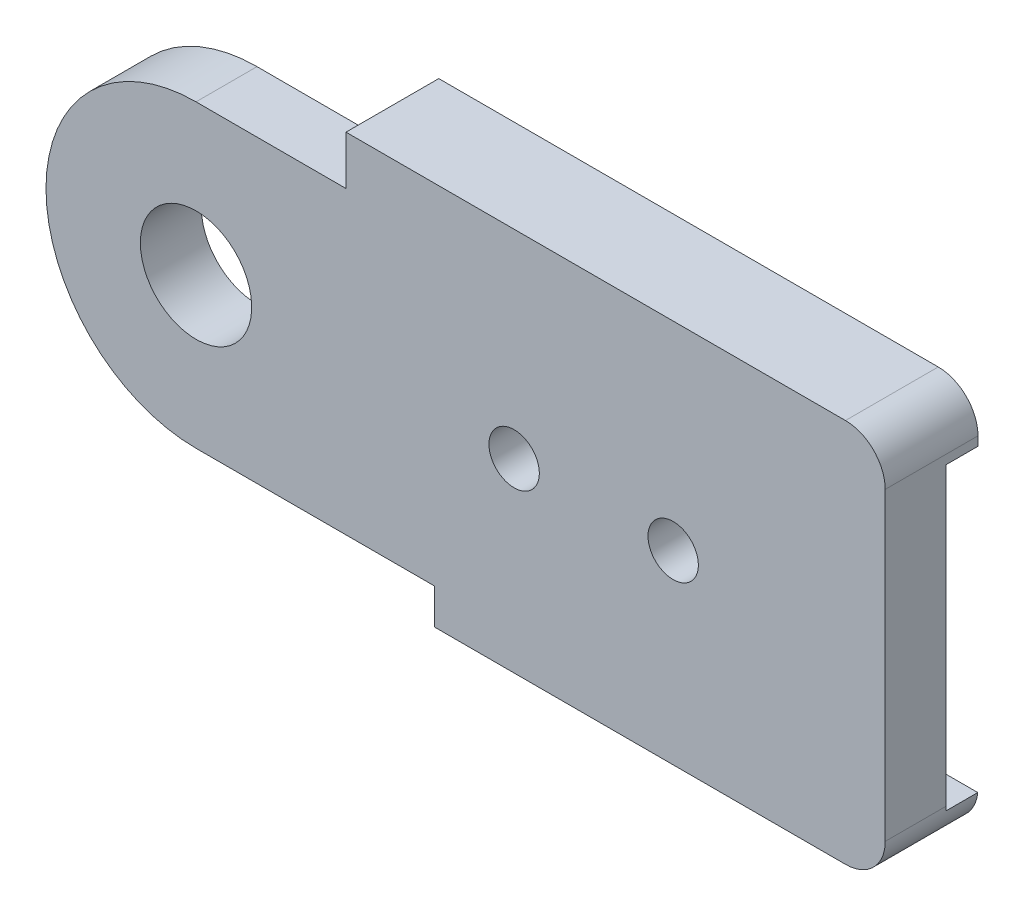
ISO-10303-21;
HEADER;
FILE_DESCRIPTION(('STEP AP214'),'2;1');
FILE_NAME('part.step','',(''),(''),'','','');
FILE_SCHEMA(('AUTOMOTIVE_DESIGN { 1 0 10303 214 1 1 1 1 }'));
ENDSEC;
DATA;
#1=APPLICATION_CONTEXT('core data for automotive mechanical design processes');
#2=APPLICATION_PROTOCOL_DEFINITION('international standard','automotive_design',2000,#1);
#3=PRODUCT_CONTEXT('',#1,'mechanical');
#4=PRODUCT('Part','Part','',(#3));
#5=PRODUCT_RELATED_PRODUCT_CATEGORY('part','',(#4));
#6=PRODUCT_DEFINITION_FORMATION('','',#4);
#7=PRODUCT_DEFINITION_CONTEXT('part definition',#1,'design');
#8=PRODUCT_DEFINITION('design','',#6,#7);
#9=PRODUCT_DEFINITION_SHAPE('','',#8);
#10=(LENGTH_UNIT() NAMED_UNIT(*) SI_UNIT(.MILLI.,.METRE.));
#11=(NAMED_UNIT(*) PLANE_ANGLE_UNIT() SI_UNIT($,.RADIAN.));
#12=(NAMED_UNIT(*) SI_UNIT($,.STERADIAN.) SOLID_ANGLE_UNIT());
#13=UNCERTAINTY_MEASURE_WITH_UNIT(LENGTH_MEASURE(1.E-05),#10,'distance_accuracy_value','');
#14=(GEOMETRIC_REPRESENTATION_CONTEXT(3) GLOBAL_UNCERTAINTY_ASSIGNED_CONTEXT((#13)) GLOBAL_UNIT_ASSIGNED_CONTEXT((#10,
#11,#12)) REPRESENTATION_CONTEXT('',''));
#15=CARTESIAN_POINT('',(0.,0.,0.));
#16=DIRECTION('',(0.,0.,1.));
#17=DIRECTION('',(1.,0.,0.));
#18=AXIS2_PLACEMENT_3D('',#15,#16,#17);
#19=CARTESIAN_POINT('',(12.,0.,-6.));
#20=DIRECTION('',(0.,0.,1.));
#21=DIRECTION('',(1.,0.,0.));
#22=AXIS2_PLACEMENT_3D('',#19,#20,#21);
#23=CYLINDRICAL_SURFACE('',#22,2.5);
#24=CARTESIAN_POINT('',(12.,0.,-6.));
#25=DIRECTION('',(0.,0.,-1.));
#26=DIRECTION('',(-1.,0.,0.));
#27=AXIS2_PLACEMENT_3D('',#24,#25,#26);
#28=CIRCLE('',#27,2.5);
#29=CARTESIAN_POINT('',(9.50000000000001,0.,-6.));
#30=VERTEX_POINT('',#29);
#31=EDGE_CURVE('E223',#30,#30,#28,.T.);
#32=ORIENTED_EDGE('',*,*,#31,.F.);
#33=EDGE_LOOP('',(#32));
#34=FACE_BOUND('',#33,.T.);
#35=CARTESIAN_POINT('',(12.,0.,-4.8));
#36=DIRECTION('',(0.,0.,-1.));
#37=DIRECTION('',(-1.,0.,0.));
#38=AXIS2_PLACEMENT_3D('',#35,#36,#37);
#39=CIRCLE('',#38,2.5);
#40=CARTESIAN_POINT('',(9.50000000000001,0.,-4.8));
#41=VERTEX_POINT('',#40);
#42=EDGE_CURVE('E219',#41,#41,#39,.T.);
#43=ORIENTED_EDGE('',*,*,#42,.T.);
#44=EDGE_LOOP('',(#43));
#45=FACE_BOUND('',#44,.T.);
#46=ADVANCED_FACE('F40',(#34,#45),#23,.T.);
#47=CARTESIAN_POINT('',(18.,0.,-6.));
#48=DIRECTION('',(0.,0.,1.));
#49=DIRECTION('',(1.,0.,0.));
#50=AXIS2_PLACEMENT_3D('',#47,#48,#49);
#51=CYLINDRICAL_SURFACE('',#50,2.5);
#52=CARTESIAN_POINT('',(18.,0.,-6.));
#53=DIRECTION('',(0.,0.,-1.));
#54=DIRECTION('',(-1.,0.,0.));
#55=AXIS2_PLACEMENT_3D('',#52,#53,#54);
#56=CIRCLE('',#55,2.5);
#57=CARTESIAN_POINT('',(15.5,0.,-6.));
#58=VERTEX_POINT('',#57);
#59=EDGE_CURVE('E215',#58,#58,#56,.T.);
#60=ORIENTED_EDGE('',*,*,#59,.F.);
#61=EDGE_LOOP('',(#60));
#62=FACE_BOUND('',#61,.T.);
#63=CARTESIAN_POINT('',(18.,0.,-4.8));
#64=DIRECTION('',(0.,0.,-1.));
#65=DIRECTION('',(-1.,0.,0.));
#66=AXIS2_PLACEMENT_3D('',#63,#64,#65);
#67=CIRCLE('',#66,2.5);
#68=CARTESIAN_POINT('',(15.5,0.,-4.8));
#69=VERTEX_POINT('',#68);
#70=EDGE_CURVE('E211',#69,#69,#67,.T.);
#71=ORIENTED_EDGE('',*,*,#70,.T.);
#72=EDGE_LOOP('',(#71));
#73=FACE_BOUND('',#72,.T.);
#74=ADVANCED_FACE('F405',(#62,#73),#51,.T.);
#75=CARTESIAN_POINT('',(26.,5.65685424949239,-6.));
#76=DIRECTION('',(0.,1.,0.));
#77=DIRECTION('',(-1.,0.,0.));
#78=AXIS2_PLACEMENT_3D('',#75,#76,#77);
#79=PLANE('',#78);
#80=DIRECTION('',(-1.,0.,0.));
#81=VECTOR('',#80,1.);
#82=CARTESIAN_POINT('',(26.,5.65685424949239,-4.8));
#83=LINE('',#82,#81);
#84=CARTESIAN_POINT('',(26.,5.65685424949239,-4.8));
#85=VERTEX_POINT('',#84);
#86=CARTESIAN_POINT('',(5.65685424949238,5.65685424949239,-4.8));
#87=VERTEX_POINT('',#86);
#88=EDGE_CURVE('E179',#85,#87,#83,.T.);
#89=ORIENTED_EDGE('',*,*,#88,.T.);
#90=DIRECTION('',(0.,0.,1.));
#91=VECTOR('',#90,1.);
#92=CARTESIAN_POINT('',(5.65685424949238,5.65685424949239,-6.));
#93=LINE('',#92,#91);
#94=CARTESIAN_POINT('',(5.65685424949238,5.65685424949239,-6.));
#95=VERTEX_POINT('',#94);
#96=EDGE_CURVE('E202',#95,#87,#93,.T.);
#97=ORIENTED_EDGE('',*,*,#96,.F.);
#98=DIRECTION('',(-1.,0.,0.));
#99=VECTOR('',#98,1.);
#100=CARTESIAN_POINT('',(26.,5.65685424949239,-6.));
#101=LINE('',#100,#99);
#102=CARTESIAN_POINT('',(26.,5.65685424949239,-6.));
#103=VERTEX_POINT('',#102);
#104=EDGE_CURVE('E180',#103,#95,#101,.T.);
#105=ORIENTED_EDGE('',*,*,#104,.F.);
#106=DIRECTION('',(0.,0.,1.));
#107=VECTOR('',#106,1.);
#108=CARTESIAN_POINT('',(26.,5.65685424949239,-6.));
#109=LINE('',#108,#107);
#110=EDGE_CURVE('E195',#103,#85,#109,.T.);
#111=ORIENTED_EDGE('',*,*,#110,.T.);
#112=EDGE_LOOP('',(#89,#97,#105,#111));
#113=FACE_BOUND('',#112,.T.);
#114=ADVANCED_FACE('F372',(#113),#79,.F.);
#115=CARTESIAN_POINT('',(9.00000000000001,-7.00163526528755,2.));
#116=DIRECTION('',(1.,0.,0.));
#117=DIRECTION('',(0.,0.,-1.));
#118=AXIS2_PLACEMENT_3D('',#115,#116,#117);
#119=PLANE('',#118);
#120=DIRECTION('',(0.,0.,-1.));
#121=VECTOR('',#120,1.);
#122=CARTESIAN_POINT('',(9.00000000000001,-7.00163526528755,2.));
#123=LINE('',#122,#121);
#124=CARTESIAN_POINT('',(9.00000000000001,-7.00163526528755,-2.5));
#125=VERTEX_POINT('',#124);
#126=CARTESIAN_POINT('',(9.00000000000001,-7.00163526528755,-6.));
#127=VERTEX_POINT('',#126);
#128=EDGE_CURVE('E139',#125,#127,#123,.T.);
#129=ORIENTED_EDGE('',*,*,#128,.F.);
#130=DIRECTION('',(0.,1.,0.));
#131=VECTOR('',#130,1.);
#132=CARTESIAN_POINT('',(9.00000000000001,-7.00163526528755,-2.5));
#133=LINE('',#132,#131);
#134=CARTESIAN_POINT('',(9.00000000000001,-5.6599991249669,-2.5));
#135=VERTEX_POINT('',#134);
#136=EDGE_CURVE('E315',#125,#135,#133,.T.);
#137=ORIENTED_EDGE('',*,*,#136,.T.);
#138=DIRECTION('',(0.,0.,1.));
#139=VECTOR('',#138,1.);
#140=CARTESIAN_POINT('',(9.00000000000001,-5.6599991249669,-4.8));
#141=LINE('',#140,#139);
#142=CARTESIAN_POINT('',(9.00000000000001,-5.6599991249669,-4.8));
#143=VERTEX_POINT('',#142);
#144=EDGE_CURVE('E253',#143,#135,#141,.T.);
#145=ORIENTED_EDGE('',*,*,#144,.F.);
#146=DIRECTION('',(0.,0.,1.));
#147=VECTOR('',#146,1.);
#148=CARTESIAN_POINT('',(9.00000000000001,-5.6599991249669,-6.));
#149=LINE('',#148,#147);
#150=CARTESIAN_POINT('',(9.00000000000001,-5.6599991249669,-6.));
#151=VERTEX_POINT('',#150);
#152=EDGE_CURVE('E166',#151,#143,#149,.T.);
#153=ORIENTED_EDGE('',*,*,#152,.F.);
#154=DIRECTION('',(0.,1.,0.));
#155=VECTOR('',#154,1.);
#156=CARTESIAN_POINT('',(9.00000000000001,-7.00163526528755,-6.));
#157=LINE('',#156,#155);
#158=EDGE_CURVE('E156',#127,#151,#157,.T.);
#159=ORIENTED_EDGE('',*,*,#158,.F.);
#160=EDGE_LOOP('',(#129,#137,#145,#153,#159));
#161=FACE_BOUND('',#160,.T.);
#162=ADVANCED_FACE('F163',(#161),#119,.F.);
#163=CARTESIAN_POINT('',(0.,-5.6599991249669,-4.8));
#164=DIRECTION('',(0.,1.,0.));
#165=DIRECTION('',(0.,0.,1.));
#166=AXIS2_PLACEMENT_3D('',#163,#164,#165);
#167=PLANE('',#166);
#168=DIRECTION('',(-1.,0.,0.));
#169=VECTOR('',#168,1.);
#170=CARTESIAN_POINT('',(0.,-5.6599991249669,-2.5));
#171=LINE('',#170,#169);
#172=CARTESIAN_POINT('',(0.,-5.6599991249669,-2.5));
#173=VERTEX_POINT('',#172);
#174=EDGE_CURVE('E238',#135,#173,#171,.T.);
#175=ORIENTED_EDGE('',*,*,#174,.T.);
#176=DIRECTION('',(0.,0.,1.));
#177=VECTOR('',#176,1.);
#178=CARTESIAN_POINT('',(0.,-5.6599991249669,-4.8));
#179=LINE('',#178,#177);
#180=CARTESIAN_POINT('',(0.,-5.6599991249669,-4.8));
#181=VERTEX_POINT('',#180);
#182=EDGE_CURVE('E277',#181,#173,#179,.T.);
#183=ORIENTED_EDGE('',*,*,#182,.F.);
#184=DIRECTION('',(-1.,0.,0.));
#185=VECTOR('',#184,1.);
#186=CARTESIAN_POINT('',(0.,-5.6599991249669,-4.8));
#187=LINE('',#186,#185);
#188=EDGE_CURVE('E239',#143,#181,#187,.T.);
#189=ORIENTED_EDGE('',*,*,#188,.F.);
#190=ORIENTED_EDGE('',*,*,#144,.T.);
#191=EDGE_LOOP('',(#175,#183,#189,#190));
#192=FACE_BOUND('',#191,.T.);
#193=ADVANCED_FACE('F352',(#192),#167,.F.);
#194=CARTESIAN_POINT('',(0.,0.,-4.8));
#195=DIRECTION('',(0.,0.,1.));
#196=DIRECTION('',(1.,0.,0.));
#197=AXIS2_PLACEMENT_3D('',#194,#195,#196);
#198=CYLINDRICAL_SURFACE('',#197,5.65999868763295);
#199=CARTESIAN_POINT('',(0.,0.,-2.5));
#200=DIRECTION('',(0.,0.,-1.));
#201=DIRECTION('',(-1.,0.,0.));
#202=AXIS2_PLACEMENT_3D('',#199,#200,#201);
#203=CIRCLE('',#202,5.65999868763295);
#204=CARTESIAN_POINT('',(0.,5.65999912496691,-2.5));
#205=VERTEX_POINT('',#204);
#206=EDGE_CURVE('E257',#173,#205,#203,.T.);
#207=ORIENTED_EDGE('',*,*,#206,.T.);
#208=DIRECTION('',(0.,0.,1.));
#209=VECTOR('',#208,1.);
#210=CARTESIAN_POINT('',(0.,5.65999912496691,-4.8));
#211=LINE('',#210,#209);
#212=CARTESIAN_POINT('',(0.,5.65999912496691,-4.8));
#213=VERTEX_POINT('',#212);
#214=EDGE_CURVE('E273',#213,#205,#211,.T.);
#215=ORIENTED_EDGE('',*,*,#214,.F.);
#216=CARTESIAN_POINT('',(0.,0.,-4.8));
#217=DIRECTION('',(0.,0.,-1.));
#218=DIRECTION('',(-1.,0.,0.));
#219=AXIS2_PLACEMENT_3D('',#216,#217,#218);
#220=CIRCLE('',#219,5.65999868763295);
#221=EDGE_CURVE('E243',#181,#213,#220,.T.);
#222=ORIENTED_EDGE('',*,*,#221,.F.);
#223=ORIENTED_EDGE('',*,*,#182,.T.);
#224=EDGE_LOOP('',(#207,#215,#222,#223));
#225=FACE_BOUND('',#224,.T.);
#226=ADVANCED_FACE('F348',(#225),#198,.T.);
#227=CARTESIAN_POINT('',(5.65685424949238,7.49836473471238,2.));
#228=DIRECTION('',(0.,-1.,0.));
#229=DIRECTION('',(1.,0.,0.));
#230=AXIS2_PLACEMENT_3D('',#227,#228,#229);
#231=PLANE('',#230);
#232=DIRECTION('',(0.,0.,-1.));
#233=VECTOR('',#232,1.);
#234=CARTESIAN_POINT('',(5.65685424949238,7.49836473471238,2.));
#235=LINE('',#234,#233);
#236=CARTESIAN_POINT('',(5.65685424949238,7.49836473471238,-2.5));
#237=VERTEX_POINT('',#236);
#238=CARTESIAN_POINT('',(5.65685424949238,7.49836473471238,-6.));
#239=VERTEX_POINT('',#238);
#240=EDGE_CURVE('E151',#237,#239,#235,.T.);
#241=ORIENTED_EDGE('',*,*,#240,.F.);
#242=DIRECTION('',(1.,0.,0.));
#243=VECTOR('',#242,1.);
#244=CARTESIAN_POINT('',(5.65685424949238,7.49836473471238,-2.5));
#245=LINE('',#244,#243);
#246=CARTESIAN_POINT('',(24.5,7.49836473471239,-2.5));
#247=VERTEX_POINT('',#246);
#248=EDGE_CURVE('E58',#237,#247,#245,.T.);
#249=ORIENTED_EDGE('',*,*,#248,.T.);
#250=DIRECTION('',(0.,0.,-1.));
#251=VECTOR('',#250,1.);
#252=CARTESIAN_POINT('',(24.5,7.49836473471239,2.));
#253=LINE('',#252,#251);
#254=CARTESIAN_POINT('',(24.5,7.49836473471239,-6.));
#255=VERTEX_POINT('',#254);
#256=EDGE_CURVE('E300',#247,#255,#253,.T.);
#257=ORIENTED_EDGE('',*,*,#256,.T.);
#258=DIRECTION('',(1.,0.,0.));
#259=VECTOR('',#258,1.);
#260=CARTESIAN_POINT('',(5.65685424949238,7.49836473471238,-6.));
#261=LINE('',#260,#259);
#262=EDGE_CURVE('E188',#239,#255,#261,.T.);
#263=ORIENTED_EDGE('',*,*,#262,.F.);
#264=EDGE_LOOP('',(#241,#249,#257,#263));
#265=FACE_BOUND('',#264,.T.);
#266=ADVANCED_FACE('F351',(#265),#231,.F.);
#267=CARTESIAN_POINT('',(0.,0.,-6.));
#268=DIRECTION('',(0.,0.,-1.));
#269=DIRECTION('',(-1.,0.,0.));
#270=AXIS2_PLACEMENT_3D('',#267,#268,#269);
#271=PLANE('',#270);
#272=ORIENTED_EDGE('',*,*,#262,.T.);
#273=CARTESIAN_POINT('',(24.5,5.99836473471239,-6.));
#274=DIRECTION('',(0.,0.,-1.));
#275=DIRECTION('',(-1.,0.,0.));
#276=AXIS2_PLACEMENT_3D('',#273,#274,#275);
#277=CIRCLE('',#276,1.5);
#278=CARTESIAN_POINT('',(26.,5.99836473471239,-6.));
#279=VERTEX_POINT('',#278);
#280=EDGE_CURVE('E303',#255,#279,#277,.T.);
#281=ORIENTED_EDGE('',*,*,#280,.T.);
#282=DIRECTION('',(0.,-1.,0.));
#283=VECTOR('',#282,1.);
#284=CARTESIAN_POINT('',(26.,7.49836473471239,-6.));
#285=LINE('',#284,#283);
#286=EDGE_CURVE('E192',#279,#103,#285,.T.);
#287=ORIENTED_EDGE('',*,*,#286,.T.);
#288=ORIENTED_EDGE('',*,*,#104,.T.);
#289=DIRECTION('',(0.,1.,0.));
#290=VECTOR('',#289,1.);
#291=CARTESIAN_POINT('',(5.65685424949238,5.65685424949239,-6.));
#292=LINE('',#291,#290);
#293=EDGE_CURVE('E184',#95,#239,#292,.T.);
#294=ORIENTED_EDGE('',*,*,#293,.T.);
#295=EDGE_LOOP('',(#272,#281,#287,#288,#294));
#296=FACE_BOUND('',#295,.T.);
#297=ADVANCED_FACE('F363',(#296),#271,.T.);
#298=CARTESIAN_POINT('',(26.,-7.00163526528755,2.));
#299=DIRECTION('',(-1.,0.,0.));
#300=DIRECTION('',(0.,0.,1.));
#301=AXIS2_PLACEMENT_3D('',#298,#299,#300);
#302=PLANE('',#301);
#303=DIRECTION('',(0.,0.,-1.));
#304=VECTOR('',#303,1.);
#305=CARTESIAN_POINT('',(26.,5.99836473471239,2.));
#306=LINE('',#305,#304);
#307=CARTESIAN_POINT('',(26.,5.99836473471239,-2.5));
#308=VERTEX_POINT('',#307);
#309=EDGE_CURVE('E150',#279,#308,#306,.F.);
#310=ORIENTED_EDGE('',*,*,#309,.T.);
#311=DIRECTION('',(0.,-1.,0.));
#312=VECTOR('',#311,1.);
#313=CARTESIAN_POINT('',(26.,0.,-2.5));
#314=LINE('',#313,#312);
#315=CARTESIAN_POINT('',(26.,-5.50163526528755,-2.5));
#316=VERTEX_POINT('',#315);
#317=EDGE_CURVE('E64',#308,#316,#314,.T.);
#318=ORIENTED_EDGE('',*,*,#317,.T.);
#319=DIRECTION('',(0.,0.,-1.));
#320=VECTOR('',#319,1.);
#321=CARTESIAN_POINT('',(26.,-5.50163526528755,2.));
#322=LINE('',#321,#320);
#323=CARTESIAN_POINT('',(26.,-5.50163526528755,-4.8));
#324=VERTEX_POINT('',#323);
#325=EDGE_CURVE('E286',#316,#324,#322,.T.);
#326=ORIENTED_EDGE('',*,*,#325,.T.);
#327=DIRECTION('',(0.,-1.,0.));
#328=VECTOR('',#327,1.);
#329=CARTESIAN_POINT('',(26.,0.,-4.8));
#330=LINE('',#329,#328);
#331=EDGE_CURVE('E249',#85,#324,#330,.T.);
#332=ORIENTED_EDGE('',*,*,#331,.F.);
#333=ORIENTED_EDGE('',*,*,#110,.F.);
#334=ORIENTED_EDGE('',*,*,#286,.F.);
#335=EDGE_LOOP('',(#310,#318,#326,#332,#333,#334));
#336=FACE_BOUND('',#335,.T.);
#337=ADVANCED_FACE('F364',(#336),#302,.F.);
#338=CARTESIAN_POINT('',(24.5,5.99836473471239,2.));
#339=DIRECTION('',(0.,0.,-1.));
#340=DIRECTION('',(-1.,0.,0.));
#341=AXIS2_PLACEMENT_3D('',#338,#339,#340);
#342=CYLINDRICAL_SURFACE('',#341,1.5);
#343=CARTESIAN_POINT('',(24.5,5.99836473471239,-2.5));
#344=DIRECTION('',(0.,0.,-1.));
#345=DIRECTION('',(-1.,0.,0.));
#346=AXIS2_PLACEMENT_3D('',#343,#344,#345);
#347=CIRCLE('',#346,1.5);
#348=EDGE_CURVE('E11',#308,#247,#347,.F.);
#349=ORIENTED_EDGE('',*,*,#348,.F.);
#350=ORIENTED_EDGE('',*,*,#309,.F.);
#351=ORIENTED_EDGE('',*,*,#280,.F.);
#352=ORIENTED_EDGE('',*,*,#256,.F.);
#353=EDGE_LOOP('',(#349,#350,#351,#352));
#354=FACE_BOUND('',#353,.T.);
#355=ADVANCED_FACE('F367',(#354),#342,.T.);
#356=CARTESIAN_POINT('',(0.,0.,-4.8));
#357=DIRECTION('',(0.,0.,-1.));
#358=DIRECTION('',(-1.,0.,0.));
#359=AXIS2_PLACEMENT_3D('',#356,#357,#358);
#360=PLANE('',#359);
#361=ORIENTED_EDGE('',*,*,#70,.F.);
#362=EDGE_LOOP('',(#361));
#363=FACE_BOUND('',#362,.T.);
#364=ORIENTED_EDGE('',*,*,#42,.F.);
#365=EDGE_LOOP('',(#364));
#366=FACE_BOUND('',#365,.T.);
#367=CARTESIAN_POINT('',(0.,0.,-4.8));
#368=DIRECTION('',(0.,0.,-1.));
#369=DIRECTION('',(-1.,0.,0.));
#370=AXIS2_PLACEMENT_3D('',#367,#368,#369);
#371=CIRCLE('',#370,2.1);
#372=CARTESIAN_POINT('',(-2.1,0.,-4.8));
#373=VERTEX_POINT('',#372);
#374=EDGE_CURVE('E227',#373,#373,#371,.T.);
#375=ORIENTED_EDGE('',*,*,#374,.F.);
#376=EDGE_LOOP('',(#375));
#377=FACE_BOUND('',#376,.T.);
#378=ORIENTED_EDGE('',*,*,#331,.T.);
#379=CARTESIAN_POINT('',(24.5,-5.50163526528755,-4.8));
#380=DIRECTION('',(0.,0.,-1.));
#381=DIRECTION('',(-1.,0.,0.));
#382=AXIS2_PLACEMENT_3D('',#379,#380,#381);
#383=CIRCLE('',#382,1.5);
#384=CARTESIAN_POINT('',(25.9916168703616,-5.6599991249669,-4.8));
#385=VERTEX_POINT('',#384);
#386=EDGE_CURVE('E289',#324,#385,#383,.T.);
#387=ORIENTED_EDGE('',*,*,#386,.T.);
#388=DIRECTION('',(1.,0.,0.));
#389=VECTOR('',#388,1.);
#390=CARTESIAN_POINT('',(9.00000000000001,-5.6599991249669,-4.8));
#391=LINE('',#390,#389);
#392=EDGE_CURVE('E161',#143,#385,#391,.T.);
#393=ORIENTED_EDGE('',*,*,#392,.F.);
#394=ORIENTED_EDGE('',*,*,#188,.T.);
#395=ORIENTED_EDGE('',*,*,#221,.T.);
#396=DIRECTION('',(0.999999845465009,-0.000555940607591913,0.));
#397=VECTOR('',#396,1.);
#398=CARTESIAN_POINT('',(0.00314662286624039,5.65999737563121,-4.8));
#399=LINE('',#398,#397);
#400=EDGE_CURVE('E246',#213,#87,#399,.T.);
#401=ORIENTED_EDGE('',*,*,#400,.T.);
#402=ORIENTED_EDGE('',*,*,#88,.F.);
#403=EDGE_LOOP('',(#378,#387,#393,#394,#395,#401,#402));
#404=FACE_BOUND('',#403,.T.);
#405=ADVANCED_FACE('F340',(#363,#366,#377,#404),#360,.T.);
#406=CARTESIAN_POINT('',(9.00000000000001,-5.6599991249669,-6.));
#407=DIRECTION('',(0.,-1.,0.));
#408=DIRECTION('',(1.,0.,0.));
#409=AXIS2_PLACEMENT_3D('',#406,#407,#408);
#410=PLANE('',#409);
#411=ORIENTED_EDGE('',*,*,#392,.T.);
#412=DIRECTION('',(0.,0.,-1.));
#413=VECTOR('',#412,1.);
#414=CARTESIAN_POINT('',(25.9916168703616,-5.6599991249669,-4.8));
#415=LINE('',#414,#413);
#416=CARTESIAN_POINT('',(25.9916168703616,-5.6599991249669,-6.));
#417=VERTEX_POINT('',#416);
#418=EDGE_CURVE('E292',#385,#417,#415,.T.);
#419=ORIENTED_EDGE('',*,*,#418,.T.);
#420=DIRECTION('',(1.,0.,0.));
#421=VECTOR('',#420,1.);
#422=CARTESIAN_POINT('',(9.00000000000001,-5.6599991249669,-6.));
#423=LINE('',#422,#421);
#424=EDGE_CURVE('E169',#151,#417,#423,.T.);
#425=ORIENTED_EDGE('',*,*,#424,.F.);
#426=ORIENTED_EDGE('',*,*,#152,.T.);
#427=EDGE_LOOP('',(#411,#419,#425,#426));
#428=FACE_BOUND('',#427,.T.);
#429=ADVANCED_FACE('F378',(#428),#410,.F.);
#430=CARTESIAN_POINT('',(0.,0.,-6.));
#431=DIRECTION('',(0.,0.,-1.));
#432=DIRECTION('',(-1.,0.,0.));
#433=AXIS2_PLACEMENT_3D('',#430,#431,#432);
#434=PLANE('',#433);
#435=ORIENTED_EDGE('',*,*,#424,.T.);
#436=CARTESIAN_POINT('',(24.5,-5.50163526528755,-6.));
#437=DIRECTION('',(0.,0.,-1.));
#438=DIRECTION('',(-1.,0.,0.));
#439=AXIS2_PLACEMENT_3D('',#436,#437,#438);
#440=CIRCLE('',#439,1.5);
#441=CARTESIAN_POINT('',(24.5,-7.00163526528755,-6.));
#442=VERTEX_POINT('',#441);
#443=EDGE_CURVE('E159',#417,#442,#440,.T.);
#444=ORIENTED_EDGE('',*,*,#443,.T.);
#445=DIRECTION('',(-1.,0.,0.));
#446=VECTOR('',#445,1.);
#447=CARTESIAN_POINT('',(26.,-7.00163526528755,-6.));
#448=LINE('',#447,#446);
#449=EDGE_CURVE('E143',#442,#127,#448,.T.);
#450=ORIENTED_EDGE('',*,*,#449,.T.);
#451=ORIENTED_EDGE('',*,*,#158,.T.);
#452=EDGE_LOOP('',(#435,#444,#450,#451));
#453=FACE_BOUND('',#452,.T.);
#454=ADVANCED_FACE('F155',(#453),#434,.T.);
#455=CARTESIAN_POINT('',(26.,-7.00163526528755,2.));
#456=DIRECTION('',(0.,1.,0.));
#457=DIRECTION('',(-1.,0.,0.));
#458=AXIS2_PLACEMENT_3D('',#455,#456,#457);
#459=PLANE('',#458);
#460=DIRECTION('',(0.,0.,-1.));
#461=VECTOR('',#460,1.);
#462=CARTESIAN_POINT('',(24.5,-7.00163526528755,2.));
#463=LINE('',#462,#461);
#464=CARTESIAN_POINT('',(24.5,-7.00163526528755,-2.5));
#465=VERTEX_POINT('',#464);
#466=EDGE_CURVE('E297',#442,#465,#463,.F.);
#467=ORIENTED_EDGE('',*,*,#466,.T.);
#468=DIRECTION('',(-1.,0.,0.));
#469=VECTOR('',#468,1.);
#470=CARTESIAN_POINT('',(26.,-7.00163526528755,-2.5));
#471=LINE('',#470,#469);
#472=EDGE_CURVE('E146',#465,#125,#471,.T.);
#473=ORIENTED_EDGE('',*,*,#472,.T.);
#474=ORIENTED_EDGE('',*,*,#128,.T.);
#475=ORIENTED_EDGE('',*,*,#449,.F.);
#476=EDGE_LOOP('',(#467,#473,#474,#475));
#477=FACE_BOUND('',#476,.T.);
#478=ADVANCED_FACE('F142',(#477),#459,.F.);
#479=CARTESIAN_POINT('',(24.5,-5.50163526528755,2.));
#480=DIRECTION('',(0.,0.,-1.));
#481=DIRECTION('',(-1.,0.,0.));
#482=AXIS2_PLACEMENT_3D('',#479,#480,#481);
#483=CYLINDRICAL_SURFACE('',#482,1.5);
#484=CARTESIAN_POINT('',(24.5,-5.50163526528755,-2.5));
#485=DIRECTION('',(0.,0.,-1.));
#486=DIRECTION('',(-1.,0.,0.));
#487=AXIS2_PLACEMENT_3D('',#484,#485,#486);
#488=CIRCLE('',#487,1.5);
#489=EDGE_CURVE('E50',#465,#316,#488,.F.);
#490=ORIENTED_EDGE('',*,*,#489,.F.);
#491=ORIENTED_EDGE('',*,*,#466,.F.);
#492=ORIENTED_EDGE('',*,*,#443,.F.);
#493=ORIENTED_EDGE('',*,*,#418,.F.);
#494=ORIENTED_EDGE('',*,*,#386,.F.);
#495=ORIENTED_EDGE('',*,*,#325,.F.);
#496=EDGE_LOOP('',(#490,#491,#492,#493,#494,#495));
#497=FACE_BOUND('',#496,.T.);
#498=ADVANCED_FACE('F42',(#497),#483,.T.);
#499=CARTESIAN_POINT('',(0.,0.,-2.3));
#500=DIRECTION('',(0.,0.,-1.));
#501=DIRECTION('',(-1.,0.,0.));
#502=AXIS2_PLACEMENT_3D('',#499,#500,#501);
#503=CYLINDRICAL_SURFACE('',#502,2.1);
#504=ORIENTED_EDGE('',*,*,#374,.T.);
#505=EDGE_LOOP('',(#504));
#506=FACE_BOUND('',#505,.T.);
#507=CARTESIAN_POINT('',(0.,0.,-2.5));
#508=DIRECTION('',(0.,0.,-1.));
#509=DIRECTION('',(-1.,0.,0.));
#510=AXIS2_PLACEMENT_3D('',#507,#508,#509);
#511=CIRCLE('',#510,2.1);
#512=CARTESIAN_POINT('',(-2.1,0.,-2.5));
#513=VERTEX_POINT('',#512);
#514=EDGE_CURVE('E234',#513,#513,#511,.T.);
#515=ORIENTED_EDGE('',*,*,#514,.F.);
#516=EDGE_LOOP('',(#515));
#517=FACE_BOUND('',#516,.T.);
#518=ADVANCED_FACE('F359',(#506,#517),#503,.F.);
#519=CARTESIAN_POINT('',(5.65685424949238,5.65685424949239,2.));
#520=DIRECTION('',(1.,0.,0.));
#521=DIRECTION('',(0.,0.,-1.));
#522=AXIS2_PLACEMENT_3D('',#519,#520,#521);
#523=PLANE('',#522);
#524=DIRECTION('',(0.,0.,1.));
#525=VECTOR('',#524,1.);
#526=CARTESIAN_POINT('',(5.65685424949238,5.65685424949239,-4.8));
#527=LINE('',#526,#525);
#528=CARTESIAN_POINT('',(5.65685424949238,5.65685424949239,-2.5));
#529=VERTEX_POINT('',#528);
#530=EDGE_CURVE('E269',#87,#529,#527,.T.);
#531=ORIENTED_EDGE('',*,*,#530,.T.);
#532=DIRECTION('',(0.,1.,0.));
#533=VECTOR('',#532,1.);
#534=CARTESIAN_POINT('',(5.65685424949238,5.65685424949239,-2.5));
#535=LINE('',#534,#533);
#536=EDGE_CURVE('E305',#529,#237,#535,.T.);
#537=ORIENTED_EDGE('',*,*,#536,.T.);
#538=ORIENTED_EDGE('',*,*,#240,.T.);
#539=ORIENTED_EDGE('',*,*,#293,.F.);
#540=ORIENTED_EDGE('',*,*,#96,.T.);
#541=EDGE_LOOP('',(#531,#537,#538,#539,#540));
#542=FACE_BOUND('',#541,.T.);
#543=ADVANCED_FACE('F346',(#542),#523,.F.);
#544=CARTESIAN_POINT('',(0.00314662286624039,5.65999737563121,-4.8));
#545=DIRECTION('',(-0.000555940607591913,-0.999999845465008,0.));
#546=DIRECTION('',(0.999999845465009,-0.000555940607591913,0.));
#547=AXIS2_PLACEMENT_3D('',#544,#545,#546);
#548=PLANE('',#547);
#549=DIRECTION('',(0.999999845465009,-0.000555940607591913,0.));
#550=VECTOR('',#549,1.);
#551=CARTESIAN_POINT('',(0.00314662286624039,5.65999737563121,-2.5));
#552=LINE('',#551,#550);
#553=EDGE_CURVE('E260',#205,#529,#552,.T.);
#554=ORIENTED_EDGE('',*,*,#553,.T.);
#555=ORIENTED_EDGE('',*,*,#530,.F.);
#556=ORIENTED_EDGE('',*,*,#400,.F.);
#557=ORIENTED_EDGE('',*,*,#214,.T.);
#558=EDGE_LOOP('',(#554,#555,#556,#557));
#559=FACE_BOUND('',#558,.T.);
#560=ADVANCED_FACE('F342',(#559),#548,.F.);
#561=CARTESIAN_POINT('',(12.,0.,-6.));
#562=DIRECTION('',(0.,0.,-1.));
#563=DIRECTION('',(-1.,0.,0.));
#564=AXIS2_PLACEMENT_3D('',#561,#562,#563);
#565=PLANE('',#564);
#566=CARTESIAN_POINT('',(12.,0.,-6.));
#567=DIRECTION('',(0.,0.,-1.));
#568=DIRECTION('',(-1.,0.,0.));
#569=AXIS2_PLACEMENT_3D('',#566,#567,#568);
#570=CIRCLE('',#569,0.949999999999999);
#571=CARTESIAN_POINT('',(11.05,0.,-6.));
#572=VERTEX_POINT('',#571);
#573=EDGE_CURVE('E206',#572,#572,#570,.T.);
#574=ORIENTED_EDGE('',*,*,#573,.F.);
#575=EDGE_LOOP('',(#574));
#576=FACE_BOUND('',#575,.T.);
#577=ORIENTED_EDGE('',*,*,#31,.T.);
#578=EDGE_LOOP('',(#577));
#579=FACE_BOUND('',#578,.T.);
#580=ADVANCED_FACE('F345',(#576,#579),#565,.T.);
#581=CARTESIAN_POINT('',(12.,0.,3.2));
#582=DIRECTION('',(0.,0.,-1.));
#583=DIRECTION('',(-1.,0.,0.));
#584=AXIS2_PLACEMENT_3D('',#581,#582,#583);
#585=CYLINDRICAL_SURFACE('',#584,0.949999999999999);
#586=CARTESIAN_POINT('',(12.,0.,-2.5));
#587=DIRECTION('',(0.,0.,-1.));
#588=DIRECTION('',(-1.,0.,0.));
#589=AXIS2_PLACEMENT_3D('',#586,#587,#588);
#590=CIRCLE('',#589,0.949999999999999);
#591=CARTESIAN_POINT('',(11.05,0.,-2.5));
#592=VERTEX_POINT('',#591);
#593=EDGE_CURVE('E317',#592,#592,#590,.F.);
#594=ORIENTED_EDGE('',*,*,#593,.T.);
#595=EDGE_LOOP('',(#594));
#596=FACE_BOUND('',#595,.T.);
#597=ORIENTED_EDGE('',*,*,#573,.T.);
#598=EDGE_LOOP('',(#597));
#599=FACE_BOUND('',#598,.T.);
#600=ADVANCED_FACE('F415',(#596,#599),#585,.F.);
#601=CARTESIAN_POINT('',(18.,0.,-6.));
#602=DIRECTION('',(0.,0.,-1.));
#603=DIRECTION('',(-1.,0.,0.));
#604=AXIS2_PLACEMENT_3D('',#601,#602,#603);
#605=PLANE('',#604);
#606=CARTESIAN_POINT('',(18.,0.,-6.));
#607=DIRECTION('',(0.,0.,-1.));
#608=DIRECTION('',(-1.,0.,0.));
#609=AXIS2_PLACEMENT_3D('',#606,#607,#608);
#610=CIRCLE('',#609,0.950000000000001);
#611=CARTESIAN_POINT('',(17.05,0.,-6.));
#612=VERTEX_POINT('',#611);
#613=EDGE_CURVE('E207',#612,#612,#610,.T.);
#614=ORIENTED_EDGE('',*,*,#613,.F.);
#615=EDGE_LOOP('',(#614));
#616=FACE_BOUND('',#615,.T.);
#617=ORIENTED_EDGE('',*,*,#59,.T.);
#618=EDGE_LOOP('',(#617));
#619=FACE_BOUND('',#618,.T.);
#620=ADVANCED_FACE('F335',(#616,#619),#605,.T.);
#621=CARTESIAN_POINT('',(18.,0.,3.2));
#622=DIRECTION('',(0.,0.,-1.));
#623=DIRECTION('',(-1.,0.,0.));
#624=AXIS2_PLACEMENT_3D('',#621,#622,#623);
#625=CYLINDRICAL_SURFACE('',#624,0.950000000000001);
#626=CARTESIAN_POINT('',(18.,0.,-2.5));
#627=DIRECTION('',(0.,0.,-1.));
#628=DIRECTION('',(-1.,0.,0.));
#629=AXIS2_PLACEMENT_3D('',#626,#627,#628);
#630=CIRCLE('',#629,0.950000000000001);
#631=CARTESIAN_POINT('',(17.05,0.,-2.5));
#632=VERTEX_POINT('',#631);
#633=EDGE_CURVE('E44',#632,#632,#630,.F.);
#634=ORIENTED_EDGE('',*,*,#633,.T.);
#635=EDGE_LOOP('',(#634));
#636=FACE_BOUND('',#635,.T.);
#637=ORIENTED_EDGE('',*,*,#613,.T.);
#638=EDGE_LOOP('',(#637));
#639=FACE_BOUND('',#638,.T.);
#640=ADVANCED_FACE('F326',(#636,#639),#625,.F.);
#641=CARTESIAN_POINT('',(0.,0.,-2.5));
#642=DIRECTION('',(0.,0.,-1.));
#643=DIRECTION('',(-1.,0.,0.));
#644=AXIS2_PLACEMENT_3D('',#641,#642,#643);
#645=PLANE('',#644);
#646=ORIENTED_EDGE('',*,*,#317,.F.);
#647=ORIENTED_EDGE('',*,*,#348,.T.);
#648=ORIENTED_EDGE('',*,*,#248,.F.);
#649=ORIENTED_EDGE('',*,*,#536,.F.);
#650=ORIENTED_EDGE('',*,*,#553,.F.);
#651=ORIENTED_EDGE('',*,*,#206,.F.);
#652=ORIENTED_EDGE('',*,*,#174,.F.);
#653=ORIENTED_EDGE('',*,*,#136,.F.);
#654=ORIENTED_EDGE('',*,*,#472,.F.);
#655=ORIENTED_EDGE('',*,*,#489,.T.);
#656=EDGE_LOOP('',(#646,#647,#648,#649,#650,#651,#652,#653,#654,#655));
#657=FACE_BOUND('',#656,.T.);
#658=ORIENTED_EDGE('',*,*,#514,.T.);
#659=EDGE_LOOP('',(#658));
#660=FACE_BOUND('',#659,.T.);
#661=ORIENTED_EDGE('',*,*,#593,.F.);
#662=EDGE_LOOP('',(#661));
#663=FACE_BOUND('',#662,.T.);
#664=ORIENTED_EDGE('',*,*,#633,.F.);
#665=EDGE_LOOP('',(#664));
#666=FACE_BOUND('',#665,.T.);
#667=ADVANCED_FACE('F329',(#657,#660,#663,#666),#645,.F.);
#668=CLOSED_SHELL('',(#46,#74,#114,#162,#193,#226,#266,#297,#337,#355,#405,#429,#454,#478,#498,
#518,#543,#560,#580,#600,#620,#640,#667));
#669=MANIFOLD_SOLID_BREP('B2',#668);
#670=ADVANCED_BREP_SHAPE_REPRESENTATION('',(#18,#669),#14);
#671=SHAPE_DEFINITION_REPRESENTATION(#9,#670);
ENDSEC;
END-ISO-10303-21;
